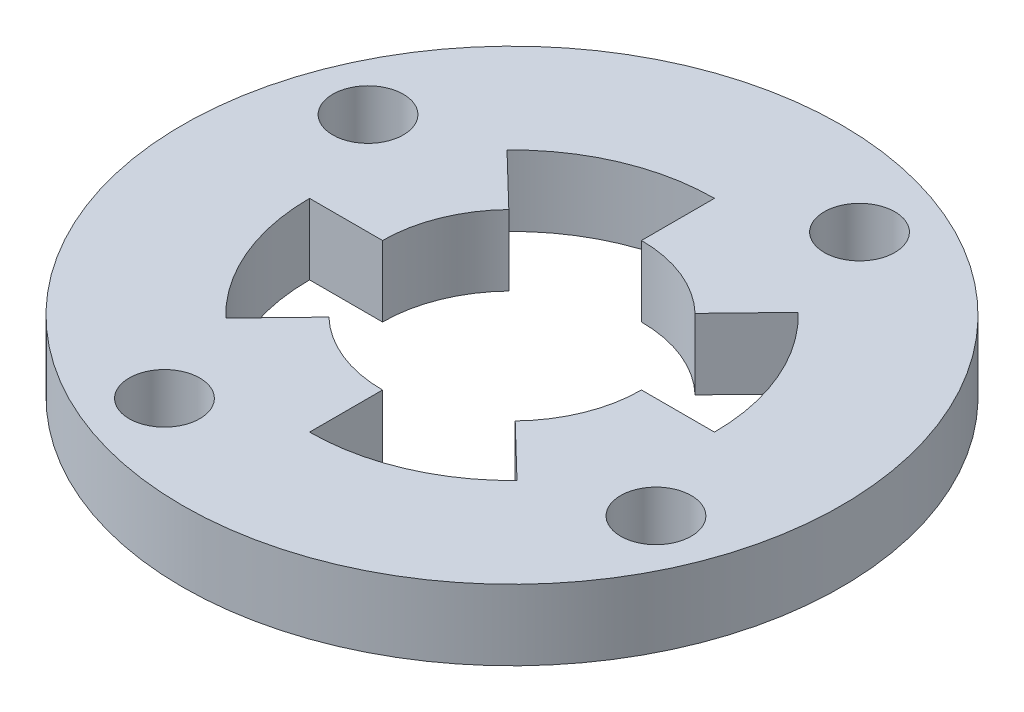
ISO-10303-21;
HEADER;
FILE_DESCRIPTION(('STEP AP214'),'2;1');
FILE_NAME('part.step','',(''),(''),'','','');
FILE_SCHEMA(('AUTOMOTIVE_DESIGN { 1 0 10303 214 1 1 1 1 }'));
ENDSEC;
DATA;
#1=APPLICATION_CONTEXT('core data for automotive mechanical design processes');
#2=APPLICATION_PROTOCOL_DEFINITION('international standard','automotive_design',2000,#1);
#3=PRODUCT_CONTEXT('',#1,'mechanical');
#4=PRODUCT('Part','Part','',(#3));
#5=PRODUCT_RELATED_PRODUCT_CATEGORY('part','',(#4));
#6=PRODUCT_DEFINITION_FORMATION('','',#4);
#7=PRODUCT_DEFINITION_CONTEXT('part definition',#1,'design');
#8=PRODUCT_DEFINITION('design','',#6,#7);
#9=PRODUCT_DEFINITION_SHAPE('','',#8);
#10=(LENGTH_UNIT() NAMED_UNIT(*) SI_UNIT(.MILLI.,.METRE.));
#11=(NAMED_UNIT(*) PLANE_ANGLE_UNIT() SI_UNIT($,.RADIAN.));
#12=(NAMED_UNIT(*) SI_UNIT($,.STERADIAN.) SOLID_ANGLE_UNIT());
#13=UNCERTAINTY_MEASURE_WITH_UNIT(LENGTH_MEASURE(1.E-05),#10,'distance_accuracy_value','');
#14=(GEOMETRIC_REPRESENTATION_CONTEXT(3) GLOBAL_UNCERTAINTY_ASSIGNED_CONTEXT((#13)) GLOBAL_UNIT_ASSIGNED_CONTEXT((#10,
#11,#12)) REPRESENTATION_CONTEXT('',''));
#15=CARTESIAN_POINT('',(0.,0.,0.));
#16=DIRECTION('',(0.,0.,1.));
#17=DIRECTION('',(1.,0.,0.));
#18=AXIS2_PLACEMENT_3D('',#15,#16,#17);
#19=CARTESIAN_POINT('',(0.,3.,0.));
#20=DIRECTION('',(0.,-1.,0.));
#21=DIRECTION('',(0.,0.,-1.));
#22=AXIS2_PLACEMENT_3D('',#19,#20,#21);
#23=CYLINDRICAL_SURFACE('',#22,5.5);
#24=CARTESIAN_POINT('',(0.,0.,0.));
#25=DIRECTION('',(0.,1.,0.));
#26=DIRECTION('',(0.,0.,1.));
#27=AXIS2_PLACEMENT_3D('',#24,#25,#26);
#28=CIRCLE('',#27,5.5);
#29=CARTESIAN_POINT('',(-3.82062103752446,0.,3.9563689018626));
#30=VERTEX_POINT('',#29);
#31=CARTESIAN_POINT('',(0.,0.,5.5));
#32=VERTEX_POINT('',#31);
#33=EDGE_CURVE('E193',#30,#32,#28,.T.);
#34=ORIENTED_EDGE('',*,*,#33,.F.);
#35=DIRECTION('',(0.,-1.,0.));
#36=VECTOR('',#35,1.);
#37=CARTESIAN_POINT('',(-3.82062103752446,3.,3.9563689018626));
#38=LINE('',#37,#36);
#39=CARTESIAN_POINT('',(-3.82062103752446,3.,3.9563689018626));
#40=VERTEX_POINT('',#39);
#41=EDGE_CURVE('E11',#40,#30,#38,.T.);
#42=ORIENTED_EDGE('',*,*,#41,.F.);
#43=CARTESIAN_POINT('',(0.,3.,0.));
#44=DIRECTION('',(0.,1.,0.));
#45=DIRECTION('',(0.,0.,1.));
#46=AXIS2_PLACEMENT_3D('',#43,#44,#45);
#47=CIRCLE('',#46,5.5);
#48=CARTESIAN_POINT('',(0.,3.,5.5));
#49=VERTEX_POINT('',#48);
#50=EDGE_CURVE('E290',#40,#49,#47,.T.);
#51=ORIENTED_EDGE('',*,*,#50,.T.);
#52=DIRECTION('',(0.,-1.,0.));
#53=VECTOR('',#52,1.);
#54=CARTESIAN_POINT('',(0.,3.,5.5));
#55=LINE('',#54,#53);
#56=EDGE_CURVE('E52',#49,#32,#55,.T.);
#57=ORIENTED_EDGE('',*,*,#56,.T.);
#58=EDGE_LOOP('',(#34,#42,#51,#57));
#59=FACE_BOUND('',#58,.T.);
#60=ADVANCED_FACE('F35',(#59),#23,.F.);
#61=CARTESIAN_POINT('',(0.,3.,0.));
#62=DIRECTION('',(-0.719339800338655,0.,-0.694658370458994));
#63=DIRECTION('',(-0.694658370458994,0.,0.719339800338655));
#64=AXIS2_PLACEMENT_3D('',#61,#62,#63);
#65=PLANE('',#64);
#66=DIRECTION('',(0.694658370458994,0.,-0.719339800338655));
#67=VECTOR('',#66,1.);
#68=CARTESIAN_POINT('',(0.,0.,0.));
#69=LINE('',#68,#67);
#70=CARTESIAN_POINT('',(-5.97406198594735,0.,6.18632228291243));
#71=VERTEX_POINT('',#70);
#72=EDGE_CURVE('E195',#71,#30,#69,.T.);
#73=ORIENTED_EDGE('',*,*,#72,.F.);
#74=DIRECTION('',(0.,-1.,0.));
#75=VECTOR('',#74,1.);
#76=CARTESIAN_POINT('',(-5.97406198594735,3.,6.18632228291243));
#77=LINE('',#76,#75);
#78=CARTESIAN_POINT('',(-5.97406198594735,3.,6.18632228291243));
#79=VERTEX_POINT('',#78);
#80=EDGE_CURVE('E44',#79,#71,#77,.T.);
#81=ORIENTED_EDGE('',*,*,#80,.F.);
#82=DIRECTION('',(0.694658370458994,0.,-0.719339800338655));
#83=VECTOR('',#82,1.);
#84=CARTESIAN_POINT('',(0.,3.,0.));
#85=LINE('',#84,#83);
#86=EDGE_CURVE('E286',#79,#40,#85,.T.);
#87=ORIENTED_EDGE('',*,*,#86,.T.);
#88=ORIENTED_EDGE('',*,*,#41,.T.);
#89=EDGE_LOOP('',(#73,#81,#87,#88));
#90=FACE_BOUND('',#89,.T.);
#91=ADVANCED_FACE('F273',(#90),#65,.T.);
#92=CARTESIAN_POINT('',(0.,3.,0.));
#93=DIRECTION('',(0.,-1.,0.));
#94=DIRECTION('',(0.,0.,-1.));
#95=AXIS2_PLACEMENT_3D('',#92,#93,#94);
#96=CYLINDRICAL_SURFACE('',#95,8.6);
#97=CARTESIAN_POINT('',(0.,0.,0.));
#98=DIRECTION('',(0.,1.,0.));
#99=DIRECTION('',(0.,0.,1.));
#100=AXIS2_PLACEMENT_3D('',#97,#98,#99);
#101=CIRCLE('',#100,8.6);
#102=CARTESIAN_POINT('',(-8.6,0.,0.));
#103=VERTEX_POINT('',#102);
#104=EDGE_CURVE('E198',#103,#71,#101,.T.);
#105=ORIENTED_EDGE('',*,*,#104,.F.);
#106=DIRECTION('',(0.,-1.,0.));
#107=VECTOR('',#106,1.);
#108=CARTESIAN_POINT('',(-8.6,3.,0.));
#109=LINE('',#108,#107);
#110=CARTESIAN_POINT('',(-8.6,3.,0.));
#111=VERTEX_POINT('',#110);
#112=EDGE_CURVE('E262',#111,#103,#109,.T.);
#113=ORIENTED_EDGE('',*,*,#112,.F.);
#114=CARTESIAN_POINT('',(0.,3.,0.));
#115=DIRECTION('',(0.,1.,0.));
#116=DIRECTION('',(0.,0.,1.));
#117=AXIS2_PLACEMENT_3D('',#114,#115,#116);
#118=CIRCLE('',#117,8.6);
#119=EDGE_CURVE('E269',#111,#79,#118,.T.);
#120=ORIENTED_EDGE('',*,*,#119,.T.);
#121=ORIENTED_EDGE('',*,*,#80,.T.);
#122=EDGE_LOOP('',(#105,#113,#120,#121));
#123=FACE_BOUND('',#122,.T.);
#124=ADVANCED_FACE('F267',(#123),#96,.F.);
#125=CARTESIAN_POINT('',(0.,3.,0.));
#126=DIRECTION('',(0.,0.,1.));
#127=DIRECTION('',(1.,0.,0.));
#128=AXIS2_PLACEMENT_3D('',#125,#126,#127);
#129=PLANE('',#128);
#130=DIRECTION('',(-1.,0.,0.));
#131=VECTOR('',#130,1.);
#132=CARTESIAN_POINT('',(0.,0.,0.));
#133=LINE('',#132,#131);
#134=CARTESIAN_POINT('',(-5.5,0.,0.));
#135=VERTEX_POINT('',#134);
#136=EDGE_CURVE('E201',#135,#103,#133,.T.);
#137=ORIENTED_EDGE('',*,*,#136,.F.);
#138=DIRECTION('',(0.,-1.,0.));
#139=VECTOR('',#138,1.);
#140=CARTESIAN_POINT('',(-5.5,3.,0.));
#141=LINE('',#140,#139);
#142=CARTESIAN_POINT('',(-5.5,3.,0.));
#143=VERTEX_POINT('',#142);
#144=EDGE_CURVE('E260',#143,#135,#141,.T.);
#145=ORIENTED_EDGE('',*,*,#144,.F.);
#146=DIRECTION('',(-1.,0.,0.));
#147=VECTOR('',#146,1.);
#148=CARTESIAN_POINT('',(0.,3.,0.));
#149=LINE('',#148,#147);
#150=EDGE_CURVE('E283',#143,#111,#149,.T.);
#151=ORIENTED_EDGE('',*,*,#150,.T.);
#152=ORIENTED_EDGE('',*,*,#112,.T.);
#153=EDGE_LOOP('',(#137,#145,#151,#152));
#154=FACE_BOUND('',#153,.T.);
#155=ADVANCED_FACE('F280',(#154),#129,.T.);
#156=CARTESIAN_POINT('',(0.,3.,0.));
#157=DIRECTION('',(0.,-1.,0.));
#158=DIRECTION('',(0.,0.,-1.));
#159=AXIS2_PLACEMENT_3D('',#156,#157,#158);
#160=CYLINDRICAL_SURFACE('',#159,5.5);
#161=CARTESIAN_POINT('',(0.,0.,0.));
#162=DIRECTION('',(0.,1.,0.));
#163=DIRECTION('',(0.,0.,1.));
#164=AXIS2_PLACEMENT_3D('',#161,#162,#163);
#165=CIRCLE('',#164,5.5);
#166=CARTESIAN_POINT('',(-3.9563689018626,0.,-3.82062103752447));
#167=VERTEX_POINT('',#166);
#168=EDGE_CURVE('E204',#167,#135,#165,.T.);
#169=ORIENTED_EDGE('',*,*,#168,.F.);
#170=DIRECTION('',(0.,-1.,0.));
#171=VECTOR('',#170,1.);
#172=CARTESIAN_POINT('',(-3.9563689018626,3.,-3.82062103752447));
#173=LINE('',#172,#171);
#174=CARTESIAN_POINT('',(-3.9563689018626,3.,-3.82062103752447));
#175=VERTEX_POINT('',#174);
#176=EDGE_CURVE('E258',#175,#167,#173,.T.);
#177=ORIENTED_EDGE('',*,*,#176,.F.);
#178=CARTESIAN_POINT('',(0.,3.,0.));
#179=DIRECTION('',(0.,1.,0.));
#180=DIRECTION('',(0.,0.,1.));
#181=AXIS2_PLACEMENT_3D('',#178,#179,#180);
#182=CIRCLE('',#181,5.5);
#183=EDGE_CURVE('E288',#175,#143,#182,.T.);
#184=ORIENTED_EDGE('',*,*,#183,.T.);
#185=ORIENTED_EDGE('',*,*,#144,.T.);
#186=EDGE_LOOP('',(#169,#177,#184,#185));
#187=FACE_BOUND('',#186,.T.);
#188=ADVANCED_FACE('F508',(#187),#160,.F.);
#189=CARTESIAN_POINT('',(0.,3.,0.));
#190=DIRECTION('',(0.694658370458994,0.,-0.719339800338655));
#191=DIRECTION('',(-0.719339800338655,0.,-0.694658370458994));
#192=AXIS2_PLACEMENT_3D('',#189,#190,#191);
#193=PLANE('',#192);
#194=DIRECTION('',(0.719339800338655,0.,0.694658370458994));
#195=VECTOR('',#194,1.);
#196=CARTESIAN_POINT('',(0.,0.,0.));
#197=LINE('',#196,#195);
#198=CARTESIAN_POINT('',(-6.18632228291243,0.,-5.97406198594735));
#199=VERTEX_POINT('',#198);
#200=EDGE_CURVE('E207',#199,#167,#197,.T.);
#201=ORIENTED_EDGE('',*,*,#200,.F.);
#202=DIRECTION('',(0.,-1.,0.));
#203=VECTOR('',#202,1.);
#204=CARTESIAN_POINT('',(-6.18632228291243,3.,-5.97406198594735));
#205=LINE('',#204,#203);
#206=CARTESIAN_POINT('',(-6.18632228291243,3.,-5.97406198594735));
#207=VERTEX_POINT('',#206);
#208=EDGE_CURVE('E256',#207,#199,#205,.T.);
#209=ORIENTED_EDGE('',*,*,#208,.F.);
#210=DIRECTION('',(0.719339800338655,0.,0.694658370458994));
#211=VECTOR('',#210,1.);
#212=CARTESIAN_POINT('',(0.,3.,0.));
#213=LINE('',#212,#211);
#214=EDGE_CURVE('E295',#207,#175,#213,.T.);
#215=ORIENTED_EDGE('',*,*,#214,.T.);
#216=ORIENTED_EDGE('',*,*,#176,.T.);
#217=EDGE_LOOP('',(#201,#209,#215,#216));
#218=FACE_BOUND('',#217,.T.);
#219=ADVANCED_FACE('F498',(#218),#193,.T.);
#220=CARTESIAN_POINT('',(0.,3.,0.));
#221=DIRECTION('',(0.,-1.,0.));
#222=DIRECTION('',(0.,0.,-1.));
#223=AXIS2_PLACEMENT_3D('',#220,#221,#222);
#224=CYLINDRICAL_SURFACE('',#223,8.6);
#225=CARTESIAN_POINT('',(0.,0.,0.));
#226=DIRECTION('',(0.,1.,0.));
#227=DIRECTION('',(0.,0.,1.));
#228=AXIS2_PLACEMENT_3D('',#225,#226,#227);
#229=CIRCLE('',#228,8.6);
#230=CARTESIAN_POINT('',(0.,0.,-8.6));
#231=VERTEX_POINT('',#230);
#232=EDGE_CURVE('E210',#231,#199,#229,.T.);
#233=ORIENTED_EDGE('',*,*,#232,.F.);
#234=DIRECTION('',(0.,-1.,0.));
#235=VECTOR('',#234,1.);
#236=CARTESIAN_POINT('',(0.,3.,-8.6));
#237=LINE('',#236,#235);
#238=CARTESIAN_POINT('',(0.,3.,-8.6));
#239=VERTEX_POINT('',#238);
#240=EDGE_CURVE('E254',#239,#231,#237,.T.);
#241=ORIENTED_EDGE('',*,*,#240,.F.);
#242=CARTESIAN_POINT('',(0.,3.,0.));
#243=DIRECTION('',(0.,1.,0.));
#244=DIRECTION('',(0.,0.,1.));
#245=AXIS2_PLACEMENT_3D('',#242,#243,#244);
#246=CIRCLE('',#245,8.6);
#247=EDGE_CURVE('E298',#239,#207,#246,.T.);
#248=ORIENTED_EDGE('',*,*,#247,.T.);
#249=ORIENTED_EDGE('',*,*,#208,.T.);
#250=EDGE_LOOP('',(#233,#241,#248,#249));
#251=FACE_BOUND('',#250,.T.);
#252=ADVANCED_FACE('F487',(#251),#224,.F.);
#253=CARTESIAN_POINT('',(0.,3.,0.));
#254=DIRECTION('',(-1.,0.,0.));
#255=DIRECTION('',(0.,0.,1.));
#256=AXIS2_PLACEMENT_3D('',#253,#254,#255);
#257=PLANE('',#256);
#258=DIRECTION('',(0.,0.,-1.));
#259=VECTOR('',#258,1.);
#260=CARTESIAN_POINT('',(0.,0.,0.));
#261=LINE('',#260,#259);
#262=CARTESIAN_POINT('',(0.,0.,-5.5));
#263=VERTEX_POINT('',#262);
#264=EDGE_CURVE('E213',#263,#231,#261,.T.);
#265=ORIENTED_EDGE('',*,*,#264,.F.);
#266=DIRECTION('',(0.,-1.,0.));
#267=VECTOR('',#266,1.);
#268=CARTESIAN_POINT('',(0.,3.,-5.5));
#269=LINE('',#268,#267);
#270=CARTESIAN_POINT('',(0.,3.,-5.5));
#271=VERTEX_POINT('',#270);
#272=EDGE_CURVE('E252',#271,#263,#269,.T.);
#273=ORIENTED_EDGE('',*,*,#272,.F.);
#274=DIRECTION('',(0.,0.,-1.));
#275=VECTOR('',#274,1.);
#276=CARTESIAN_POINT('',(0.,3.,0.));
#277=LINE('',#276,#275);
#278=EDGE_CURVE('E301',#271,#239,#277,.T.);
#279=ORIENTED_EDGE('',*,*,#278,.T.);
#280=ORIENTED_EDGE('',*,*,#240,.T.);
#281=EDGE_LOOP('',(#265,#273,#279,#280));
#282=FACE_BOUND('',#281,.T.);
#283=ADVANCED_FACE('F477',(#282),#257,.T.);
#284=CARTESIAN_POINT('',(0.,3.,0.));
#285=DIRECTION('',(0.,-1.,0.));
#286=DIRECTION('',(0.,0.,-1.));
#287=AXIS2_PLACEMENT_3D('',#284,#285,#286);
#288=CYLINDRICAL_SURFACE('',#287,5.5);
#289=CARTESIAN_POINT('',(0.,0.,0.));
#290=DIRECTION('',(0.,1.,0.));
#291=DIRECTION('',(0.,0.,1.));
#292=AXIS2_PLACEMENT_3D('',#289,#290,#291);
#293=CIRCLE('',#292,5.5);
#294=CARTESIAN_POINT('',(3.82062103752446,0.,-3.9563689018626));
#295=VERTEX_POINT('',#294);
#296=EDGE_CURVE('E216',#295,#263,#293,.T.);
#297=ORIENTED_EDGE('',*,*,#296,.F.);
#298=DIRECTION('',(0.,-1.,0.));
#299=VECTOR('',#298,1.);
#300=CARTESIAN_POINT('',(3.82062103752446,3.,-3.9563689018626));
#301=LINE('',#300,#299);
#302=CARTESIAN_POINT('',(3.82062103752446,3.,-3.9563689018626));
#303=VERTEX_POINT('',#302);
#304=EDGE_CURVE('E250',#303,#295,#301,.T.);
#305=ORIENTED_EDGE('',*,*,#304,.F.);
#306=CARTESIAN_POINT('',(0.,3.,0.));
#307=DIRECTION('',(0.,1.,0.));
#308=DIRECTION('',(0.,0.,1.));
#309=AXIS2_PLACEMENT_3D('',#306,#307,#308);
#310=CIRCLE('',#309,5.5);
#311=EDGE_CURVE('E304',#303,#271,#310,.T.);
#312=ORIENTED_EDGE('',*,*,#311,.T.);
#313=ORIENTED_EDGE('',*,*,#272,.T.);
#314=EDGE_LOOP('',(#297,#305,#312,#313));
#315=FACE_BOUND('',#314,.T.);
#316=ADVANCED_FACE('F467',(#315),#288,.F.);
#317=CARTESIAN_POINT('',(0.,3.,0.));
#318=DIRECTION('',(0.719339800338655,0.,0.694658370458993));
#319=DIRECTION('',(0.694658370458994,0.,-0.719339800338655));
#320=AXIS2_PLACEMENT_3D('',#317,#318,#319);
#321=PLANE('',#320);
#322=DIRECTION('',(-0.694658370458994,0.,0.719339800338655));
#323=VECTOR('',#322,1.);
#324=CARTESIAN_POINT('',(0.,0.,0.));
#325=LINE('',#324,#323);
#326=CARTESIAN_POINT('',(5.97406198594734,0.,-6.18632228291243));
#327=VERTEX_POINT('',#326);
#328=EDGE_CURVE('E219',#327,#295,#325,.T.);
#329=ORIENTED_EDGE('',*,*,#328,.F.);
#330=DIRECTION('',(0.,-1.,0.));
#331=VECTOR('',#330,1.);
#332=CARTESIAN_POINT('',(5.97406198594734,3.,-6.18632228291243));
#333=LINE('',#332,#331);
#334=CARTESIAN_POINT('',(5.97406198594734,3.,-6.18632228291243));
#335=VERTEX_POINT('',#334);
#336=EDGE_CURVE('E248',#335,#327,#333,.T.);
#337=ORIENTED_EDGE('',*,*,#336,.F.);
#338=DIRECTION('',(-0.694658370458994,0.,0.719339800338655));
#339=VECTOR('',#338,1.);
#340=CARTESIAN_POINT('',(0.,3.,0.));
#341=LINE('',#340,#339);
#342=EDGE_CURVE('E307',#335,#303,#341,.T.);
#343=ORIENTED_EDGE('',*,*,#342,.T.);
#344=ORIENTED_EDGE('',*,*,#304,.T.);
#345=EDGE_LOOP('',(#329,#337,#343,#344));
#346=FACE_BOUND('',#345,.T.);
#347=ADVANCED_FACE('F457',(#346),#321,.T.);
#348=CARTESIAN_POINT('',(0.,3.,0.));
#349=DIRECTION('',(0.,-1.,0.));
#350=DIRECTION('',(0.,0.,-1.));
#351=AXIS2_PLACEMENT_3D('',#348,#349,#350);
#352=CYLINDRICAL_SURFACE('',#351,8.6);
#353=CARTESIAN_POINT('',(0.,0.,0.));
#354=DIRECTION('',(0.,1.,0.));
#355=DIRECTION('',(0.,0.,1.));
#356=AXIS2_PLACEMENT_3D('',#353,#354,#355);
#357=CIRCLE('',#356,8.6);
#358=CARTESIAN_POINT('',(8.6,0.,0.));
#359=VERTEX_POINT('',#358);
#360=EDGE_CURVE('E222',#359,#327,#357,.T.);
#361=ORIENTED_EDGE('',*,*,#360,.F.);
#362=DIRECTION('',(0.,-1.,0.));
#363=VECTOR('',#362,1.);
#364=CARTESIAN_POINT('',(8.6,3.,0.));
#365=LINE('',#364,#363);
#366=CARTESIAN_POINT('',(8.6,3.,0.));
#367=VERTEX_POINT('',#366);
#368=EDGE_CURVE('E246',#367,#359,#365,.T.);
#369=ORIENTED_EDGE('',*,*,#368,.F.);
#370=CARTESIAN_POINT('',(0.,3.,0.));
#371=DIRECTION('',(0.,1.,0.));
#372=DIRECTION('',(0.,0.,1.));
#373=AXIS2_PLACEMENT_3D('',#370,#371,#372);
#374=CIRCLE('',#373,8.6);
#375=EDGE_CURVE('E310',#367,#335,#374,.T.);
#376=ORIENTED_EDGE('',*,*,#375,.T.);
#377=ORIENTED_EDGE('',*,*,#336,.T.);
#378=EDGE_LOOP('',(#361,#369,#376,#377));
#379=FACE_BOUND('',#378,.T.);
#380=ADVANCED_FACE('F446',(#379),#352,.F.);
#381=CARTESIAN_POINT('',(0.,3.,0.));
#382=DIRECTION('',(0.,0.,-1.));
#383=DIRECTION('',(-1.,0.,0.));
#384=AXIS2_PLACEMENT_3D('',#381,#382,#383);
#385=PLANE('',#384);
#386=DIRECTION('',(1.,0.,0.));
#387=VECTOR('',#386,1.);
#388=CARTESIAN_POINT('',(0.,0.,0.));
#389=LINE('',#388,#387);
#390=CARTESIAN_POINT('',(5.5,0.,0.));
#391=VERTEX_POINT('',#390);
#392=EDGE_CURVE('E225',#391,#359,#389,.T.);
#393=ORIENTED_EDGE('',*,*,#392,.F.);
#394=DIRECTION('',(0.,-1.,0.));
#395=VECTOR('',#394,1.);
#396=CARTESIAN_POINT('',(5.5,3.,0.));
#397=LINE('',#396,#395);
#398=CARTESIAN_POINT('',(5.5,3.,0.));
#399=VERTEX_POINT('',#398);
#400=EDGE_CURVE('E244',#399,#391,#397,.T.);
#401=ORIENTED_EDGE('',*,*,#400,.F.);
#402=DIRECTION('',(1.,0.,0.));
#403=VECTOR('',#402,1.);
#404=CARTESIAN_POINT('',(0.,3.,0.));
#405=LINE('',#404,#403);
#406=EDGE_CURVE('E313',#399,#367,#405,.T.);
#407=ORIENTED_EDGE('',*,*,#406,.T.);
#408=ORIENTED_EDGE('',*,*,#368,.T.);
#409=EDGE_LOOP('',(#393,#401,#407,#408));
#410=FACE_BOUND('',#409,.T.);
#411=ADVANCED_FACE('F437',(#410),#385,.T.);
#412=CARTESIAN_POINT('',(0.,3.,0.));
#413=DIRECTION('',(0.,-1.,0.));
#414=DIRECTION('',(0.,0.,-1.));
#415=AXIS2_PLACEMENT_3D('',#412,#413,#414);
#416=CYLINDRICAL_SURFACE('',#415,5.5);
#417=CARTESIAN_POINT('',(0.,0.,0.));
#418=DIRECTION('',(0.,1.,0.));
#419=DIRECTION('',(0.,0.,1.));
#420=AXIS2_PLACEMENT_3D('',#417,#418,#419);
#421=CIRCLE('',#420,5.5);
#422=CARTESIAN_POINT('',(3.9563689018626,0.,3.82062103752446));
#423=VERTEX_POINT('',#422);
#424=EDGE_CURVE('E228',#423,#391,#421,.T.);
#425=ORIENTED_EDGE('',*,*,#424,.F.);
#426=DIRECTION('',(0.,-1.,0.));
#427=VECTOR('',#426,1.);
#428=CARTESIAN_POINT('',(3.9563689018626,3.,3.82062103752446));
#429=LINE('',#428,#427);
#430=CARTESIAN_POINT('',(3.9563689018626,3.,3.82062103752446));
#431=VERTEX_POINT('',#430);
#432=EDGE_CURVE('E159',#431,#423,#429,.T.);
#433=ORIENTED_EDGE('',*,*,#432,.F.);
#434=CARTESIAN_POINT('',(0.,3.,0.));
#435=DIRECTION('',(0.,1.,0.));
#436=DIRECTION('',(0.,0.,1.));
#437=AXIS2_PLACEMENT_3D('',#434,#435,#436);
#438=CIRCLE('',#437,5.5);
#439=EDGE_CURVE('E170',#431,#399,#438,.T.);
#440=ORIENTED_EDGE('',*,*,#439,.T.);
#441=ORIENTED_EDGE('',*,*,#400,.T.);
#442=EDGE_LOOP('',(#425,#433,#440,#441));
#443=FACE_BOUND('',#442,.T.);
#444=ADVANCED_FACE('F317',(#443),#416,.F.);
#445=CARTESIAN_POINT('',(0.,3.,0.));
#446=DIRECTION('',(-0.694658370458993,0.,0.719339800338655));
#447=DIRECTION('',(0.719339800338655,0.,0.694658370458993));
#448=AXIS2_PLACEMENT_3D('',#445,#446,#447);
#449=PLANE('',#448);
#450=DIRECTION('',(-0.719339800338655,0.,-0.694658370458993));
#451=VECTOR('',#450,1.);
#452=CARTESIAN_POINT('',(0.,0.,0.));
#453=LINE('',#452,#451);
#454=CARTESIAN_POINT('',(6.18632228291243,0.,5.97406198594734));
#455=VERTEX_POINT('',#454);
#456=EDGE_CURVE('E155',#455,#423,#453,.T.);
#457=ORIENTED_EDGE('',*,*,#456,.F.);
#458=DIRECTION('',(0.,-1.,0.));
#459=VECTOR('',#458,1.);
#460=CARTESIAN_POINT('',(6.18632228291243,3.,5.97406198594734));
#461=LINE('',#460,#459);
#462=CARTESIAN_POINT('',(6.18632228291243,3.,5.97406198594734));
#463=VERTEX_POINT('',#462);
#464=EDGE_CURVE('E150',#463,#455,#461,.T.);
#465=ORIENTED_EDGE('',*,*,#464,.F.);
#466=DIRECTION('',(-0.719339800338655,0.,-0.694658370458993));
#467=VECTOR('',#466,1.);
#468=CARTESIAN_POINT('',(0.,3.,0.));
#469=LINE('',#468,#467);
#470=EDGE_CURVE('E153',#463,#431,#469,.T.);
#471=ORIENTED_EDGE('',*,*,#470,.T.);
#472=ORIENTED_EDGE('',*,*,#432,.T.);
#473=EDGE_LOOP('',(#457,#465,#471,#472));
#474=FACE_BOUND('',#473,.T.);
#475=ADVANCED_FACE('F152',(#474),#449,.T.);
#476=CARTESIAN_POINT('',(0.,3.,0.));
#477=DIRECTION('',(0.,-1.,0.));
#478=DIRECTION('',(0.,0.,-1.));
#479=AXIS2_PLACEMENT_3D('',#476,#477,#478);
#480=CYLINDRICAL_SURFACE('',#479,8.6);
#481=CARTESIAN_POINT('',(0.,0.,0.));
#482=DIRECTION('',(0.,1.,0.));
#483=DIRECTION('',(0.,0.,1.));
#484=AXIS2_PLACEMENT_3D('',#481,#482,#483);
#485=CIRCLE('',#484,8.6);
#486=CARTESIAN_POINT('',(0.,0.,8.6));
#487=VERTEX_POINT('',#486);
#488=EDGE_CURVE('E232',#487,#455,#485,.T.);
#489=ORIENTED_EDGE('',*,*,#488,.F.);
#490=DIRECTION('',(0.,-1.,0.));
#491=VECTOR('',#490,1.);
#492=CARTESIAN_POINT('',(0.,3.,8.6));
#493=LINE('',#492,#491);
#494=CARTESIAN_POINT('',(0.,3.,8.6));
#495=VERTEX_POINT('',#494);
#496=EDGE_CURVE('E101',#495,#487,#493,.T.);
#497=ORIENTED_EDGE('',*,*,#496,.F.);
#498=CARTESIAN_POINT('',(0.,3.,0.));
#499=DIRECTION('',(0.,1.,0.));
#500=DIRECTION('',(0.,0.,1.));
#501=AXIS2_PLACEMENT_3D('',#498,#499,#500);
#502=CIRCLE('',#501,8.6);
#503=EDGE_CURVE('E167',#495,#463,#502,.T.);
#504=ORIENTED_EDGE('',*,*,#503,.T.);
#505=ORIENTED_EDGE('',*,*,#464,.T.);
#506=EDGE_LOOP('',(#489,#497,#504,#505));
#507=FACE_BOUND('',#506,.T.);
#508=ADVANCED_FACE('F172',(#507),#480,.F.);
#509=CARTESIAN_POINT('',(0.,3.,0.));
#510=DIRECTION('',(1.,0.,0.));
#511=DIRECTION('',(0.,0.,-1.));
#512=AXIS2_PLACEMENT_3D('',#509,#510,#511);
#513=PLANE('',#512);
#514=DIRECTION('',(0.,0.,1.));
#515=VECTOR('',#514,1.);
#516=CARTESIAN_POINT('',(0.,0.,0.));
#517=LINE('',#516,#515);
#518=EDGE_CURVE('E234',#32,#487,#517,.T.);
#519=ORIENTED_EDGE('',*,*,#518,.F.);
#520=ORIENTED_EDGE('',*,*,#56,.F.);
#521=DIRECTION('',(0.,0.,1.));
#522=VECTOR('',#521,1.);
#523=CARTESIAN_POINT('',(0.,3.,0.));
#524=LINE('',#523,#522);
#525=EDGE_CURVE('E173',#49,#495,#524,.T.);
#526=ORIENTED_EDGE('',*,*,#525,.T.);
#527=ORIENTED_EDGE('',*,*,#496,.T.);
#528=EDGE_LOOP('',(#519,#520,#526,#527));
#529=FACE_BOUND('',#528,.T.);
#530=ADVANCED_FACE('F319',(#529),#513,.T.);
#531=CARTESIAN_POINT('',(-10.4398387173775,3.,-4.32432278572555));
#532=DIRECTION('',(0.,-1.,0.));
#533=DIRECTION('',(0.,0.,-1.));
#534=AXIS2_PLACEMENT_3D('',#531,#532,#533);
#535=CYLINDRICAL_SURFACE('',#534,1.5);
#536=CARTESIAN_POINT('',(-10.4398387173775,3.,-4.32432278572555));
#537=DIRECTION('',(0.,1.,0.));
#538=DIRECTION('',(0.,0.,1.));
#539=AXIS2_PLACEMENT_3D('',#536,#537,#538);
#540=CIRCLE('',#539,1.5);
#541=CARTESIAN_POINT('',(-10.4398387173775,3.,-2.82432278572555));
#542=VERTEX_POINT('',#541);
#543=EDGE_CURVE('E580',#542,#542,#540,.T.);
#544=ORIENTED_EDGE('',*,*,#543,.T.);
#545=EDGE_LOOP('',(#544));
#546=FACE_BOUND('',#545,.T.);
#547=CARTESIAN_POINT('',(-10.4398387173775,0.,-4.32432278572555));
#548=DIRECTION('',(0.,1.,0.));
#549=DIRECTION('',(0.,0.,1.));
#550=AXIS2_PLACEMENT_3D('',#547,#548,#549);
#551=CIRCLE('',#550,1.5);
#552=CARTESIAN_POINT('',(-10.4398387173775,0.,-2.82432278572555));
#553=VERTEX_POINT('',#552);
#554=EDGE_CURVE('E190',#553,#553,#551,.T.);
#555=ORIENTED_EDGE('',*,*,#554,.F.);
#556=EDGE_LOOP('',(#555));
#557=FACE_BOUND('',#556,.T.);
#558=ADVANCED_FACE('F321',(#546,#557),#535,.F.);
#559=CARTESIAN_POINT('',(4.32432278572552,3.,-10.4398387173775));
#560=DIRECTION('',(0.,-1.,0.));
#561=DIRECTION('',(0.,0.,-1.));
#562=AXIS2_PLACEMENT_3D('',#559,#560,#561);
#563=CYLINDRICAL_SURFACE('',#562,1.50000000000005);
#564=CARTESIAN_POINT('',(4.32432278572552,3.,-10.4398387173775));
#565=DIRECTION('',(0.,1.,0.));
#566=DIRECTION('',(0.,0.,1.));
#567=AXIS2_PLACEMENT_3D('',#564,#565,#566);
#568=CIRCLE('',#567,1.50000000000005);
#569=CARTESIAN_POINT('',(4.32432278572552,3.,-8.93983871737749));
#570=VERTEX_POINT('',#569);
#571=EDGE_CURVE('E577',#570,#570,#568,.T.);
#572=ORIENTED_EDGE('',*,*,#571,.T.);
#573=EDGE_LOOP('',(#572));
#574=FACE_BOUND('',#573,.T.);
#575=CARTESIAN_POINT('',(4.32432278572552,0.,-10.4398387173775));
#576=DIRECTION('',(0.,1.,0.));
#577=DIRECTION('',(0.,0.,1.));
#578=AXIS2_PLACEMENT_3D('',#575,#576,#577);
#579=CIRCLE('',#578,1.50000000000005);
#580=CARTESIAN_POINT('',(4.32432278572552,0.,-8.93983871737749));
#581=VERTEX_POINT('',#580);
#582=EDGE_CURVE('E187',#581,#581,#579,.T.);
#583=ORIENTED_EDGE('',*,*,#582,.F.);
#584=EDGE_LOOP('',(#583));
#585=FACE_BOUND('',#584,.T.);
#586=ADVANCED_FACE('F327',(#574,#585),#563,.F.);
#587=CARTESIAN_POINT('',(10.4398387173775,3.,4.32432278572552));
#588=DIRECTION('',(0.,-1.,0.));
#589=DIRECTION('',(0.,0.,-1.));
#590=AXIS2_PLACEMENT_3D('',#587,#588,#589);
#591=CYLINDRICAL_SURFACE('',#590,1.50000000000007);
#592=CARTESIAN_POINT('',(10.4398387173775,3.,4.32432278572552));
#593=DIRECTION('',(0.,1.,0.));
#594=DIRECTION('',(0.,0.,1.));
#595=AXIS2_PLACEMENT_3D('',#592,#593,#594);
#596=CIRCLE('',#595,1.50000000000007);
#597=CARTESIAN_POINT('',(10.4398387173775,3.,5.82432278572559));
#598=VERTEX_POINT('',#597);
#599=EDGE_CURVE('E353',#598,#598,#596,.T.);
#600=ORIENTED_EDGE('',*,*,#599,.T.);
#601=EDGE_LOOP('',(#600));
#602=FACE_BOUND('',#601,.T.);
#603=CARTESIAN_POINT('',(10.4398387173775,0.,4.32432278572552));
#604=DIRECTION('',(0.,1.,0.));
#605=DIRECTION('',(0.,0.,1.));
#606=AXIS2_PLACEMENT_3D('',#603,#604,#605);
#607=CIRCLE('',#606,1.50000000000007);
#608=CARTESIAN_POINT('',(10.4398387173775,0.,5.82432278572559));
#609=VERTEX_POINT('',#608);
#610=EDGE_CURVE('E184',#609,#609,#607,.T.);
#611=ORIENTED_EDGE('',*,*,#610,.F.);
#612=EDGE_LOOP('',(#611));
#613=FACE_BOUND('',#612,.T.);
#614=ADVANCED_FACE('F341',(#602,#613),#591,.F.);
#615=CARTESIAN_POINT('',(-4.32432278572552,3.,10.4398387173775));
#616=DIRECTION('',(0.,-1.,0.));
#617=DIRECTION('',(0.,0.,-1.));
#618=AXIS2_PLACEMENT_3D('',#615,#616,#617);
#619=CYLINDRICAL_SURFACE('',#618,1.5000000000001);
#620=CARTESIAN_POINT('',(-4.32432278572552,3.,10.4398387173775));
#621=DIRECTION('',(0.,1.,0.));
#622=DIRECTION('',(0.,0.,1.));
#623=AXIS2_PLACEMENT_3D('',#620,#621,#622);
#624=CIRCLE('',#623,1.5000000000001);
#625=CARTESIAN_POINT('',(-4.32432278572552,3.,11.9398387173776));
#626=VERTEX_POINT('',#625);
#627=EDGE_CURVE('E240',#626,#626,#624,.T.);
#628=ORIENTED_EDGE('',*,*,#627,.T.);
#629=EDGE_LOOP('',(#628));
#630=FACE_BOUND('',#629,.T.);
#631=CARTESIAN_POINT('',(-4.32432278572552,0.,10.4398387173775));
#632=DIRECTION('',(0.,1.,0.));
#633=DIRECTION('',(0.,0.,1.));
#634=AXIS2_PLACEMENT_3D('',#631,#632,#633);
#635=CIRCLE('',#634,1.5000000000001);
#636=CARTESIAN_POINT('',(-4.32432278572552,0.,11.9398387173776));
#637=VERTEX_POINT('',#636);
#638=EDGE_CURVE('E181',#637,#637,#635,.T.);
#639=ORIENTED_EDGE('',*,*,#638,.F.);
#640=EDGE_LOOP('',(#639));
#641=FACE_BOUND('',#640,.T.);
#642=ADVANCED_FACE('F37',(#630,#641),#619,.F.);
#643=CARTESIAN_POINT('',(0.,3.,0.));
#644=DIRECTION('',(0.,-1.,0.));
#645=DIRECTION('',(0.,0.,-1.));
#646=AXIS2_PLACEMENT_3D('',#643,#644,#645);
#647=CYLINDRICAL_SURFACE('',#646,14.);
#648=CARTESIAN_POINT('',(0.,3.,0.));
#649=DIRECTION('',(0.,1.,0.));
#650=DIRECTION('',(0.,0.,1.));
#651=AXIS2_PLACEMENT_3D('',#648,#649,#650);
#652=CIRCLE('',#651,14.);
#653=CARTESIAN_POINT('',(0.,3.,14.));
#654=VERTEX_POINT('',#653);
#655=EDGE_CURVE('E175',#654,#654,#652,.T.);
#656=ORIENTED_EDGE('',*,*,#655,.F.);
#657=EDGE_LOOP('',(#656));
#658=FACE_BOUND('',#657,.T.);
#659=CARTESIAN_POINT('',(0.,0.,0.));
#660=DIRECTION('',(0.,1.,0.));
#661=DIRECTION('',(0.,0.,1.));
#662=AXIS2_PLACEMENT_3D('',#659,#660,#661);
#663=CIRCLE('',#662,14.);
#664=CARTESIAN_POINT('',(0.,0.,14.));
#665=VERTEX_POINT('',#664);
#666=EDGE_CURVE('E237',#665,#665,#663,.T.);
#667=ORIENTED_EDGE('',*,*,#666,.T.);
#668=EDGE_LOOP('',(#667));
#669=FACE_BOUND('',#668,.T.);
#670=ADVANCED_FACE('F348',(#658,#669),#647,.T.);
#671=CARTESIAN_POINT('',(0.,3.,0.));
#672=DIRECTION('',(0.,1.,0.));
#673=DIRECTION('',(0.,0.,1.));
#674=AXIS2_PLACEMENT_3D('',#671,#672,#673);
#675=PLANE('',#674);
#676=ORIENTED_EDGE('',*,*,#627,.F.);
#677=EDGE_LOOP('',(#676));
#678=FACE_BOUND('',#677,.T.);
#679=ORIENTED_EDGE('',*,*,#599,.F.);
#680=EDGE_LOOP('',(#679));
#681=FACE_BOUND('',#680,.T.);
#682=ORIENTED_EDGE('',*,*,#571,.F.);
#683=EDGE_LOOP('',(#682));
#684=FACE_BOUND('',#683,.T.);
#685=ORIENTED_EDGE('',*,*,#543,.F.);
#686=EDGE_LOOP('',(#685));
#687=FACE_BOUND('',#686,.T.);
#688=ORIENTED_EDGE('',*,*,#50,.F.);
#689=ORIENTED_EDGE('',*,*,#86,.F.);
#690=ORIENTED_EDGE('',*,*,#119,.F.);
#691=ORIENTED_EDGE('',*,*,#150,.F.);
#692=ORIENTED_EDGE('',*,*,#183,.F.);
#693=ORIENTED_EDGE('',*,*,#214,.F.);
#694=ORIENTED_EDGE('',*,*,#247,.F.);
#695=ORIENTED_EDGE('',*,*,#278,.F.);
#696=ORIENTED_EDGE('',*,*,#311,.F.);
#697=ORIENTED_EDGE('',*,*,#342,.F.);
#698=ORIENTED_EDGE('',*,*,#375,.F.);
#699=ORIENTED_EDGE('',*,*,#406,.F.);
#700=ORIENTED_EDGE('',*,*,#439,.F.);
#701=ORIENTED_EDGE('',*,*,#470,.F.);
#702=ORIENTED_EDGE('',*,*,#503,.F.);
#703=ORIENTED_EDGE('',*,*,#525,.F.);
#704=EDGE_LOOP('',(#688,#689,#690,#691,#692,#693,#694,#695,#696,#697,#698,#699,#700,#701,#702,#703));
#705=FACE_BOUND('',#704,.T.);
#706=ORIENTED_EDGE('',*,*,#655,.T.);
#707=EDGE_LOOP('',(#706));
#708=FACE_BOUND('',#707,.T.);
#709=ADVANCED_FACE('F164',(#678,#681,#684,#687,#705,#708),#675,.T.);
#710=CARTESIAN_POINT('',(0.,0.,0.));
#711=DIRECTION('',(0.,1.,0.));
#712=DIRECTION('',(0.,0.,1.));
#713=AXIS2_PLACEMENT_3D('',#710,#711,#712);
#714=PLANE('',#713);
#715=ORIENTED_EDGE('',*,*,#638,.T.);
#716=EDGE_LOOP('',(#715));
#717=FACE_BOUND('',#716,.T.);
#718=ORIENTED_EDGE('',*,*,#610,.T.);
#719=EDGE_LOOP('',(#718));
#720=FACE_BOUND('',#719,.T.);
#721=ORIENTED_EDGE('',*,*,#582,.T.);
#722=EDGE_LOOP('',(#721));
#723=FACE_BOUND('',#722,.T.);
#724=ORIENTED_EDGE('',*,*,#554,.T.);
#725=EDGE_LOOP('',(#724));
#726=FACE_BOUND('',#725,.T.);
#727=ORIENTED_EDGE('',*,*,#33,.T.);
#728=ORIENTED_EDGE('',*,*,#518,.T.);
#729=ORIENTED_EDGE('',*,*,#488,.T.);
#730=ORIENTED_EDGE('',*,*,#456,.T.);
#731=ORIENTED_EDGE('',*,*,#424,.T.);
#732=ORIENTED_EDGE('',*,*,#392,.T.);
#733=ORIENTED_EDGE('',*,*,#360,.T.);
#734=ORIENTED_EDGE('',*,*,#328,.T.);
#735=ORIENTED_EDGE('',*,*,#296,.T.);
#736=ORIENTED_EDGE('',*,*,#264,.T.);
#737=ORIENTED_EDGE('',*,*,#232,.T.);
#738=ORIENTED_EDGE('',*,*,#200,.T.);
#739=ORIENTED_EDGE('',*,*,#168,.T.);
#740=ORIENTED_EDGE('',*,*,#136,.T.);
#741=ORIENTED_EDGE('',*,*,#104,.T.);
#742=ORIENTED_EDGE('',*,*,#72,.T.);
#743=EDGE_LOOP('',(#727,#728,#729,#730,#731,#732,#733,#734,#735,#736,#737,#738,#739,#740,#741,#742));
#744=FACE_BOUND('',#743,.T.);
#745=ORIENTED_EDGE('',*,*,#666,.F.);
#746=EDGE_LOOP('',(#745));
#747=FACE_BOUND('',#746,.T.);
#748=ADVANCED_FACE('F275',(#717,#720,#723,#726,#744,#747),#714,.F.);
#749=CLOSED_SHELL('',(#60,#91,#124,#155,#188,#219,#252,#283,#316,#347,#380,#411,#444,#475,#508,
#530,#558,#586,#614,#642,#670,#709,#748));
#750=MANIFOLD_SOLID_BREP('B2',#749);
#751=ADVANCED_BREP_SHAPE_REPRESENTATION('',(#18,#750),#14);
#752=SHAPE_DEFINITION_REPRESENTATION(#9,#751);
ENDSEC;
END-ISO-10303-21;
